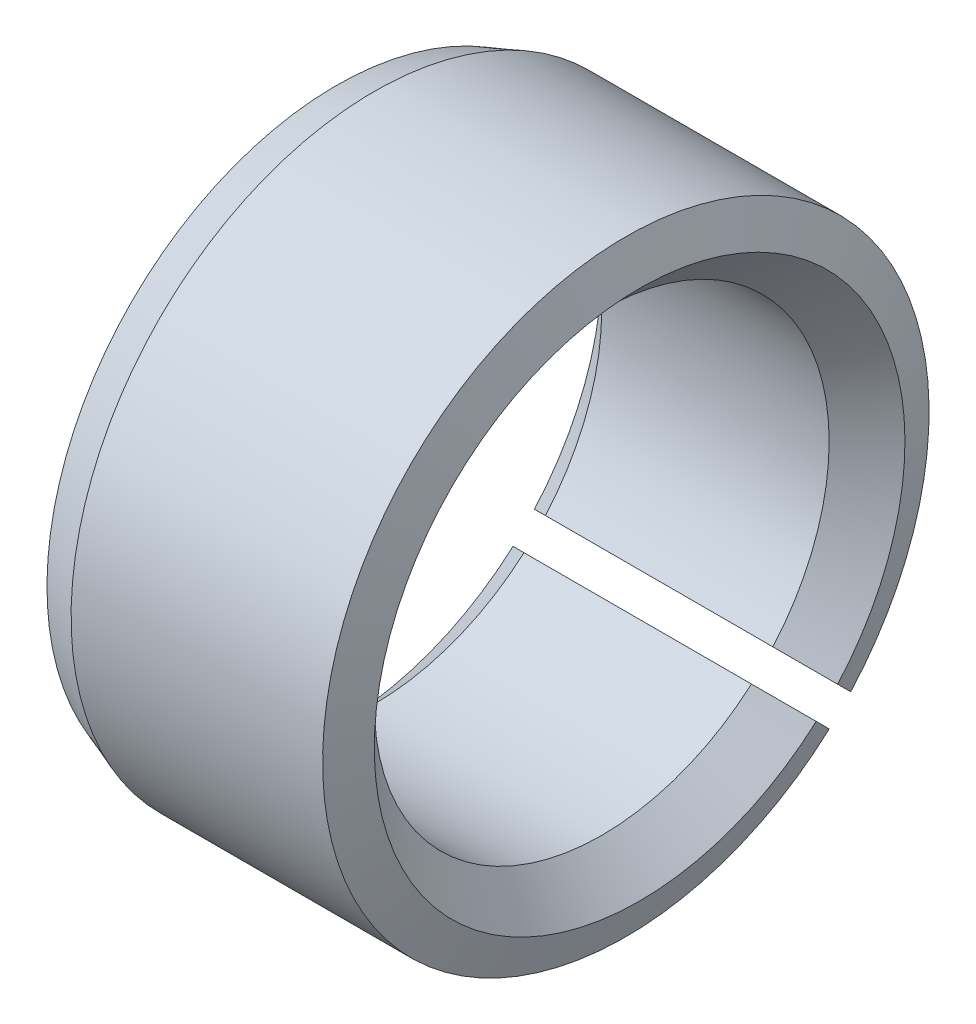
ISO-10303-21;
HEADER;
FILE_DESCRIPTION(('STEP AP214'),'2;1');
FILE_NAME('part.step','',(''),(''),'','','');
FILE_SCHEMA(('AUTOMOTIVE_DESIGN { 1 0 10303 214 1 1 1 1 }'));
ENDSEC;
DATA;
#1=APPLICATION_CONTEXT('core data for automotive mechanical design processes');
#2=APPLICATION_PROTOCOL_DEFINITION('international standard','automotive_design',2000,#1);
#3=PRODUCT_CONTEXT('',#1,'mechanical');
#4=PRODUCT('Part','Part','',(#3));
#5=PRODUCT_RELATED_PRODUCT_CATEGORY('part','',(#4));
#6=PRODUCT_DEFINITION_FORMATION('','',#4);
#7=PRODUCT_DEFINITION_CONTEXT('part definition',#1,'design');
#8=PRODUCT_DEFINITION('design','',#6,#7);
#9=PRODUCT_DEFINITION_SHAPE('','',#8);
#10=(LENGTH_UNIT() NAMED_UNIT(*) SI_UNIT(.MILLI.,.METRE.));
#11=(NAMED_UNIT(*) PLANE_ANGLE_UNIT() SI_UNIT($,.RADIAN.));
#12=(NAMED_UNIT(*) SI_UNIT($,.STERADIAN.) SOLID_ANGLE_UNIT());
#13=UNCERTAINTY_MEASURE_WITH_UNIT(LENGTH_MEASURE(1.E-05),#10,'distance_accuracy_value','');
#14=(GEOMETRIC_REPRESENTATION_CONTEXT(3) GLOBAL_UNCERTAINTY_ASSIGNED_CONTEXT((#13)) GLOBAL_UNIT_ASSIGNED_CONTEXT((#10,
#11,#12)) REPRESENTATION_CONTEXT('',''));
#15=CARTESIAN_POINT('',(0.,0.,0.));
#16=DIRECTION('',(0.,0.,1.));
#17=DIRECTION('',(1.,0.,0.));
#18=AXIS2_PLACEMENT_3D('',#15,#16,#17);
#19=CARTESIAN_POINT('',(0.,0.,0.));
#20=DIRECTION('',(1.,0.,0.));
#21=DIRECTION('',(0.,0.,-1.));
#22=AXIS2_PLACEMENT_3D('',#19,#20,#21);
#23=CYLINDRICAL_SURFACE('',#22,4.);
#24=DIRECTION('',(1.,0.,0.));
#25=VECTOR('',#24,1.);
#26=CARTESIAN_POINT('',(0.,-2.96631073460242,-2.6834680221278));
#27=LINE('',#26,#25);
#28=CARTESIAN_POINT('',(0.500000000004091,-2.96631073460242,-2.6834680221278));
#29=VERTEX_POINT('',#28);
#30=CARTESIAN_POINT('',(3.81801488287726,-2.96631073460242,-2.6834680221278));
#31=VERTEX_POINT('',#30);
#32=EDGE_CURVE('E118',#29,#31,#27,.T.);
#33=ORIENTED_EDGE('',*,*,#32,.T.);
#34=CARTESIAN_POINT('',(3.81801488287726,0.,0.));
#35=DIRECTION('',(1.,0.,0.));
#36=DIRECTION('',(0.,0.,-1.));
#37=AXIS2_PLACEMENT_3D('',#34,#35,#36);
#38=CIRCLE('',#37,4.);
#39=CARTESIAN_POINT('',(3.81801488287726,-2.6834680221278,-2.96631073460241));
#40=VERTEX_POINT('',#39);
#41=EDGE_CURVE('E54',#31,#40,#38,.F.);
#42=ORIENTED_EDGE('',*,*,#41,.T.);
#43=DIRECTION('',(1.,0.,0.));
#44=VECTOR('',#43,1.);
#45=CARTESIAN_POINT('',(0.,-2.6834680221278,-2.96631073460241));
#46=LINE('',#45,#44);
#47=CARTESIAN_POINT('',(0.500000000004092,-2.6834680221278,-2.96631073460241));
#48=VERTEX_POINT('',#47);
#49=EDGE_CURVE('E116',#48,#40,#46,.T.);
#50=ORIENTED_EDGE('',*,*,#49,.F.);
#51=CARTESIAN_POINT('',(0.500000000004091,0.,0.));
#52=DIRECTION('',(-1.,0.,0.));
#53=DIRECTION('',(0.,0.,1.));
#54=AXIS2_PLACEMENT_3D('',#51,#52,#53);
#55=CIRCLE('',#54,4.);
#56=EDGE_CURVE('E170',#48,#29,#55,.F.);
#57=ORIENTED_EDGE('',*,*,#56,.T.);
#58=EDGE_LOOP('',(#33,#42,#50,#57));
#59=FACE_BOUND('',#58,.T.);
#60=ADVANCED_FACE('F32',(#59),#23,.T.);
#61=CARTESIAN_POINT('',(0.,4.,0.));
#62=DIRECTION('',(-1.,0.,0.));
#63=DIRECTION('',(0.,0.,1.));
#64=AXIS2_PLACEMENT_3D('',#61,#62,#63);
#65=PLANE('',#64);
#66=DIRECTION('',(0.,-0.707106781186546,-0.707106781186549));
#67=VECTOR('',#66,1.);
#68=CARTESIAN_POINT('',(0.,-2.25802240508898,-1.97517969261436));
#69=LINE('',#68,#67);
#70=CARTESIAN_POINT('',(0.,-2.6122511763501,-2.32940846387549));
#71=VERTEX_POINT('',#70);
#72=CARTESIAN_POINT('',(0.,-2.8374589715046,-2.55461625902998));
#73=VERTEX_POINT('',#72);
#74=EDGE_CURVE('E120',#71,#73,#69,.T.);
#75=ORIENTED_EDGE('',*,*,#74,.T.);
#76=CARTESIAN_POINT('',(0.,0.,0.));
#77=DIRECTION('',(-1.,0.,0.));
#78=DIRECTION('',(0.,0.,1.));
#79=AXIS2_PLACEMENT_3D('',#76,#77,#78);
#80=CIRCLE('',#79,3.81801488287727);
#81=CARTESIAN_POINT('',(0.,-2.55461625902998,-2.8374589715046));
#82=VERTEX_POINT('',#81);
#83=EDGE_CURVE('E11',#73,#82,#80,.T.);
#84=ORIENTED_EDGE('',*,*,#83,.T.);
#85=DIRECTION('',(0.,0.707106781186548,0.707106781186547));
#86=VECTOR('',#85,1.);
#87=CARTESIAN_POINT('',(0.,-2.6834680221278,-2.96631073460241));
#88=LINE('',#87,#86);
#89=CARTESIAN_POINT('',(0.,-2.32940846387549,-2.6122511763501));
#90=VERTEX_POINT('',#89);
#91=EDGE_CURVE('E186',#82,#90,#88,.T.);
#92=ORIENTED_EDGE('',*,*,#91,.T.);
#93=CARTESIAN_POINT('',(0.,0.,0.));
#94=DIRECTION('',(-1.,0.,0.));
#95=DIRECTION('',(0.,0.,1.));
#96=AXIS2_PLACEMENT_3D('',#93,#94,#95);
#97=CIRCLE('',#96,3.49999999998818);
#98=EDGE_CURVE('E99',#90,#71,#97,.F.);
#99=ORIENTED_EDGE('',*,*,#98,.T.);
#100=EDGE_LOOP('',(#75,#84,#92,#99));
#101=FACE_BOUND('',#100,.T.);
#102=ADVANCED_FACE('F144',(#101),#65,.T.);
#103=CARTESIAN_POINT('',(0.,-2.25802240508898,-1.97517969261436));
#104=DIRECTION('',(0.,-0.707106781186549,0.707106781186546));
#105=DIRECTION('',(0.,-0.707106781186546,-0.707106781186549));
#106=AXIS2_PLACEMENT_3D('',#103,#104,#105);
#107=PLANE('',#106);
#108=CARTESIAN_POINT('',(3.50000000001182,-2.25802240508898,-1.97517969261436));
#109=CARTESIAN_POINT('',(3.5833210530015,-2.31706920064494,-2.03422648817032));
#110=CARTESIAN_POINT('',(3.66664824617936,-2.37611166271031,-2.09326895023569));
#111=CARTESIAN_POINT('',(3.8333149128421,-2.49418791981076,-2.21134520733614));
#112=CARTESIAN_POINT('',(3.91665438632696,-2.55322171484585,-2.27037900237123));
#113=CARTESIAN_POINT('',(4.,-2.61225117639036,-2.32940846391574));
#114=B_SPLINE_CURVE_WITH_KNOTS('',3,(#108,#109,#110,#111,#112,#113),.UNSPECIFIED.,.F.,.F.,(4,2,
4),(0.,0.353891243162976,0.707782486031489),.UNSPECIFIED.);
#115=CARTESIAN_POINT('',(3.50000000001182,-2.25802240508898,-1.97517969261436));
#116=VERTEX_POINT('',#115);
#117=CARTESIAN_POINT('',(4.,-2.61225117639036,-2.32940846391574));
#118=VERTEX_POINT('',#117);
#119=EDGE_CURVE('E192',#116,#118,#114,.T.);
#120=ORIENTED_EDGE('',*,*,#119,.T.);
#121=CARTESIAN_POINT('',(4.,-2.61225117635558,-2.32940846388096));
#122=CARTESIAN_POINT('',(3.96967426503938,-2.67126241802197,-2.38841970554735));
#123=CARTESIAN_POINT('',(3.93934597113122,-2.73027300204425,-2.44743028956963));
#124=CARTESIAN_POINT('',(3.87868426542364,-2.8482928547932,-2.56545014231858));
#125=CARTESIAN_POINT('',(3.84835085362422,-2.90730212351986,-2.62445941104525));
#126=CARTESIAN_POINT('',(3.81801488287726,-2.96631073460242,-2.6834680221278));
#127=B_SPLINE_CURVE_WITH_KNOTS('',3,(#121,#122,#123,#124,#125,#126),.UNSPECIFIED.,.F.,.F.,(4,2,
4),(0.,0.266380801076453,0.53276160211951),.UNSPECIFIED.);
#128=EDGE_CURVE('E165',#118,#31,#127,.T.);
#129=ORIENTED_EDGE('',*,*,#128,.T.);
#130=ORIENTED_EDGE('',*,*,#32,.F.);
#131=CARTESIAN_POINT('',(0.500000000004091,-2.96631073460242,-2.6834680221278));
#132=CARTESIAN_POINT('',(0.416666069402659,-2.94483659957982,-2.6619938871052));
#133=CARTESIAN_POINT('',(0.33333243743503,-2.92336188514373,-2.64051917266911));
#134=CARTESIAN_POINT('',(0.166665770767,-2.88041129744446,-2.59756858496984));
#135=CARTESIAN_POINT('',(0.0833327360665988,-2.85893542418128,-2.57609271170666));
#136=CARTESIAN_POINT('',(0.,-2.8374589715046,-2.55461625902998));
#137=B_SPLINE_CURVE_WITH_KNOTS('',3,(#131,#132,#133,#134,#135,#136),.UNSPECIFIED.,.F.,.F.,(4,2,
4),(0.,0.266085302927947,0.532170605857091),.UNSPECIFIED.);
#138=EDGE_CURVE('E171',#29,#73,#137,.T.);
#139=ORIENTED_EDGE('',*,*,#138,.T.);
#140=ORIENTED_EDGE('',*,*,#74,.F.);
#141=CARTESIAN_POINT('',(0.,-2.6122511763501,-2.32940846387548));
#142=CARTESIAN_POINT('',(0.0833456136825078,-2.5532217148123,-2.27037900233768));
#143=CARTESIAN_POINT('',(0.166685087176848,-2.49418791978392,-2.2113452073093));
#144=CARTESIAN_POINT('',(0.333351753858531,-2.37611166269689,-2.09326895022227));
#145=CARTESIAN_POINT('',(0.416678947045864,-2.31706920063823,-2.03422648816361));
#146=CARTESIAN_POINT('',(0.500000000045018,-2.25802240508898,-1.97517969261436));
#147=B_SPLINE_CURVE_WITH_KNOTS('',3,(#141,#142,#143,#144,#145,#146),.UNSPECIFIED.,.F.,.F.,(4,2,
4),(0.,0.353891242868442,0.707782486031347),.UNSPECIFIED.);
#148=CARTESIAN_POINT('',(0.500000000045019,-2.25802240508898,-1.97517969261436));
#149=VERTEX_POINT('',#148);
#150=EDGE_CURVE('E189',#71,#149,#147,.T.);
#151=ORIENTED_EDGE('',*,*,#150,.T.);
#152=DIRECTION('',(1.,0.,0.));
#153=VECTOR('',#152,1.);
#154=CARTESIAN_POINT('',(0.,-2.25802240508898,-1.97517969261436));
#155=LINE('',#154,#153);
#156=EDGE_CURVE('E111',#149,#116,#155,.T.);
#157=ORIENTED_EDGE('',*,*,#156,.T.);
#158=EDGE_LOOP('',(#120,#129,#130,#139,#140,#151,#157));
#159=FACE_BOUND('',#158,.T.);
#160=ADVANCED_FACE('F141',(#159),#107,.F.);
#161=CARTESIAN_POINT('',(0.,-2.6834680221278,-2.96631073460241));
#162=DIRECTION('',(0.,0.707106781186547,-0.707106781186548));
#163=DIRECTION('',(0.,0.707106781186548,0.707106781186547));
#164=AXIS2_PLACEMENT_3D('',#161,#162,#163);
#165=PLANE('',#164);
#166=ORIENTED_EDGE('',*,*,#49,.T.);
#167=CARTESIAN_POINT('',(3.81801488287726,-2.6834680221278,-2.96631073460241));
#168=CARTESIAN_POINT('',(3.84835085362422,-2.62445941104525,-2.90730212351986));
#169=CARTESIAN_POINT('',(3.87868426542364,-2.56545014231858,-2.8482928547932));
#170=CARTESIAN_POINT('',(3.93934597113122,-2.44743028956964,-2.73027300204425));
#171=CARTESIAN_POINT('',(3.96967426503938,-2.38841970554735,-2.67126241802197));
#172=CARTESIAN_POINT('',(4.,-2.32940846388096,-2.61225117635557));
#173=B_SPLINE_CURVE_WITH_KNOTS('',3,(#167,#168,#169,#170,#171,#172),.UNSPECIFIED.,.F.,.F.,(4,2,
4),(0.,0.266380801043057,0.532761602119509),.UNSPECIFIED.);
#174=CARTESIAN_POINT('',(4.,-2.32940846391574,-2.61225117639036));
#175=VERTEX_POINT('',#174);
#176=EDGE_CURVE('E41',#40,#175,#173,.T.);
#177=ORIENTED_EDGE('',*,*,#176,.T.);
#178=CARTESIAN_POINT('',(4.,-2.32940846391574,-2.61225117639036));
#179=CARTESIAN_POINT('',(3.91665438632696,-2.27037900237123,-2.55322171484585));
#180=CARTESIAN_POINT('',(3.8333149128421,-2.21134520733614,-2.49418791981076));
#181=CARTESIAN_POINT('',(3.66664824617936,-2.09326895023569,-2.37611166271031));
#182=CARTESIAN_POINT('',(3.5833210530015,-2.03422648817032,-2.31706920064493));
#183=CARTESIAN_POINT('',(3.50000000001182,-1.97517969261436,-2.25802240508898));
#184=B_SPLINE_CURVE_WITH_KNOTS('',3,(#178,#179,#180,#181,#182,#183),.UNSPECIFIED.,.F.,.F.,(4,2,
4),(0.,0.353891242868513,0.707782486031489),.UNSPECIFIED.);
#185=CARTESIAN_POINT('',(3.50000000001182,-1.97517969261436,-2.25802240508898));
#186=VERTEX_POINT('',#185);
#187=EDGE_CURVE('E102',#175,#186,#184,.T.);
#188=ORIENTED_EDGE('',*,*,#187,.T.);
#189=DIRECTION('',(1.,0.,0.));
#190=VECTOR('',#189,1.);
#191=CARTESIAN_POINT('',(0.,-1.97517969261436,-2.25802240508898));
#192=LINE('',#191,#190);
#193=CARTESIAN_POINT('',(0.500000000045018,-1.97517969261436,-2.25802240508898));
#194=VERTEX_POINT('',#193);
#195=EDGE_CURVE('E108',#194,#186,#192,.T.);
#196=ORIENTED_EDGE('',*,*,#195,.F.);
#197=CARTESIAN_POINT('',(0.500000000045018,-1.97517969261436,-2.25802240508898));
#198=CARTESIAN_POINT('',(0.416678947045864,-2.03422648816361,-2.31706920063823));
#199=CARTESIAN_POINT('',(0.333351753858531,-2.09326895022227,-2.37611166269689));
#200=CARTESIAN_POINT('',(0.166685087176848,-2.21134520730931,-2.49418791978392));
#201=CARTESIAN_POINT('',(0.0833456136825078,-2.27037900233768,-2.5532217148123));
#202=CARTESIAN_POINT('',(0.,-2.32940846387549,-2.6122511763501));
#203=B_SPLINE_CURVE_WITH_KNOTS('',3,(#197,#198,#199,#200,#201,#202),.UNSPECIFIED.,.F.,.F.,(4,2,
4),(0.,0.353891243162905,0.707782486031347),.UNSPECIFIED.);
#204=EDGE_CURVE('E94',#194,#90,#203,.T.);
#205=ORIENTED_EDGE('',*,*,#204,.T.);
#206=ORIENTED_EDGE('',*,*,#91,.F.);
#207=CARTESIAN_POINT('',(0.,-2.55461625902999,-2.8374589715046));
#208=CARTESIAN_POINT('',(0.0833327360665986,-2.57609271170666,-2.85893542418128));
#209=CARTESIAN_POINT('',(0.166665770766999,-2.59756858496984,-2.88041129744446));
#210=CARTESIAN_POINT('',(0.33333243743503,-2.64051917266911,-2.92336188514373));
#211=CARTESIAN_POINT('',(0.416666069402659,-2.6619938871052,-2.94483659957982));
#212=CARTESIAN_POINT('',(0.500000000004091,-2.6834680221278,-2.96631073460241));
#213=B_SPLINE_CURVE_WITH_KNOTS('',3,(#207,#208,#209,#210,#211,#212),.UNSPECIFIED.,.F.,.F.,(4,2,
4),(0.,0.266085302929144,0.532170605857091),.UNSPECIFIED.);
#214=EDGE_CURVE('E150',#82,#48,#213,.T.);
#215=ORIENTED_EDGE('',*,*,#214,.T.);
#216=EDGE_LOOP('',(#166,#177,#188,#196,#205,#206,#215));
#217=FACE_BOUND('',#216,.T.);
#218=ADVANCED_FACE('F114',(#217),#165,.F.);
#219=CARTESIAN_POINT('',(4.,0.,0.));
#220=DIRECTION('',(-1.,0.,0.));
#221=DIRECTION('',(0.,0.,1.));
#222=AXIS2_PLACEMENT_3D('',#219,#220,#221);
#223=CYLINDRICAL_SURFACE('',#222,3.);
#224=ORIENTED_EDGE('',*,*,#156,.F.);
#225=CARTESIAN_POINT('',(0.500000000045018,0.,0.));
#226=DIRECTION('',(-1.,0.,0.));
#227=DIRECTION('',(0.,0.,1.));
#228=AXIS2_PLACEMENT_3D('',#225,#226,#227);
#229=CIRCLE('',#228,3.);
#230=EDGE_CURVE('E98',#149,#194,#229,.T.);
#231=ORIENTED_EDGE('',*,*,#230,.T.);
#232=ORIENTED_EDGE('',*,*,#195,.T.);
#233=CARTESIAN_POINT('',(3.50000000001182,0.,0.));
#234=DIRECTION('',(1.,0.,0.));
#235=DIRECTION('',(0.,0.,-1.));
#236=AXIS2_PLACEMENT_3D('',#233,#234,#235);
#237=CIRCLE('',#236,3.);
#238=EDGE_CURVE('E112',#186,#116,#237,.T.);
#239=ORIENTED_EDGE('',*,*,#238,.T.);
#240=EDGE_LOOP('',(#224,#231,#232,#239));
#241=FACE_BOUND('',#240,.T.);
#242=ADVANCED_FACE('F107',(#241),#223,.F.);
#243=CARTESIAN_POINT('',(0.500000000045018,0.,0.));
#244=DIRECTION('',(-1.,0.,0.));
#245=DIRECTION('',(0.,0.,1.));
#246=AXIS2_PLACEMENT_3D('',#243,#244,#245);
#247=CONICAL_SURFACE('',#246,3.,0.785398163340608);
#248=ORIENTED_EDGE('',*,*,#150,.F.);
#249=ORIENTED_EDGE('',*,*,#98,.F.);
#250=ORIENTED_EDGE('',*,*,#204,.F.);
#251=ORIENTED_EDGE('',*,*,#230,.F.);
#252=EDGE_LOOP('',(#248,#249,#250,#251));
#253=FACE_BOUND('',#252,.T.);
#254=ADVANCED_FACE('F97',(#253),#247,.F.);
#255=CARTESIAN_POINT('',(4.,0.,0.));
#256=DIRECTION('',(1.,0.,0.));
#257=DIRECTION('',(0.,0.,-1.));
#258=AXIS2_PLACEMENT_3D('',#255,#256,#257);
#259=CONICAL_SURFACE('',#258,3.50000000004502,0.785398163454288);
#260=ORIENTED_EDGE('',*,*,#119,.F.);
#261=ORIENTED_EDGE('',*,*,#238,.F.);
#262=ORIENTED_EDGE('',*,*,#187,.F.);
#263=CARTESIAN_POINT('',(4.,0.,0.));
#264=DIRECTION('',(1.,0.,0.));
#265=DIRECTION('',(0.,0.,-1.));
#266=AXIS2_PLACEMENT_3D('',#263,#264,#265);
#267=CIRCLE('',#266,3.50000000004502);
#268=EDGE_CURVE('E187',#118,#175,#267,.F.);
#269=ORIENTED_EDGE('',*,*,#268,.F.);
#270=EDGE_LOOP('',(#260,#261,#262,#269));
#271=FACE_BOUND('',#270,.T.);
#272=ADVANCED_FACE('F135',(#271),#259,.F.);
#273=CARTESIAN_POINT('',(4.,0.,0.));
#274=DIRECTION('',(-1.,0.,0.));
#275=DIRECTION('',(0.,0.,1.));
#276=AXIS2_PLACEMENT_3D('',#273,#274,#275);
#277=CONICAL_SURFACE('',#276,3.4999999999959,1.22173047641697);
#278=ORIENTED_EDGE('',*,*,#176,.F.);
#279=ORIENTED_EDGE('',*,*,#41,.F.);
#280=ORIENTED_EDGE('',*,*,#128,.F.);
#281=ORIENTED_EDGE('',*,*,#268,.T.);
#282=EDGE_LOOP('',(#278,#279,#280,#281));
#283=FACE_BOUND('',#282,.T.);
#284=ADVANCED_FACE('F159',(#283),#277,.T.);
#285=CARTESIAN_POINT('',(0.500000000004091,0.,0.));
#286=DIRECTION('',(1.,0.,0.));
#287=DIRECTION('',(0.,0.,-1.));
#288=AXIS2_PLACEMENT_3D('',#285,#286,#287);
#289=CONICAL_SURFACE('',#288,4.,0.349065850377928);
#290=ORIENTED_EDGE('',*,*,#214,.F.);
#291=ORIENTED_EDGE('',*,*,#83,.F.);
#292=ORIENTED_EDGE('',*,*,#138,.F.);
#293=ORIENTED_EDGE('',*,*,#56,.F.);
#294=EDGE_LOOP('',(#290,#291,#292,#293));
#295=FACE_BOUND('',#294,.T.);
#296=ADVANCED_FACE('F34',(#295),#289,.T.);
#297=CLOSED_SHELL('',(#60,#102,#160,#218,#242,#254,#272,#284,#296));
#298=MANIFOLD_SOLID_BREP('B2',#297);
#299=ADVANCED_BREP_SHAPE_REPRESENTATION('',(#18,#298),#14);
#300=SHAPE_DEFINITION_REPRESENTATION(#9,#299);
ENDSEC;
END-ISO-10303-21;
